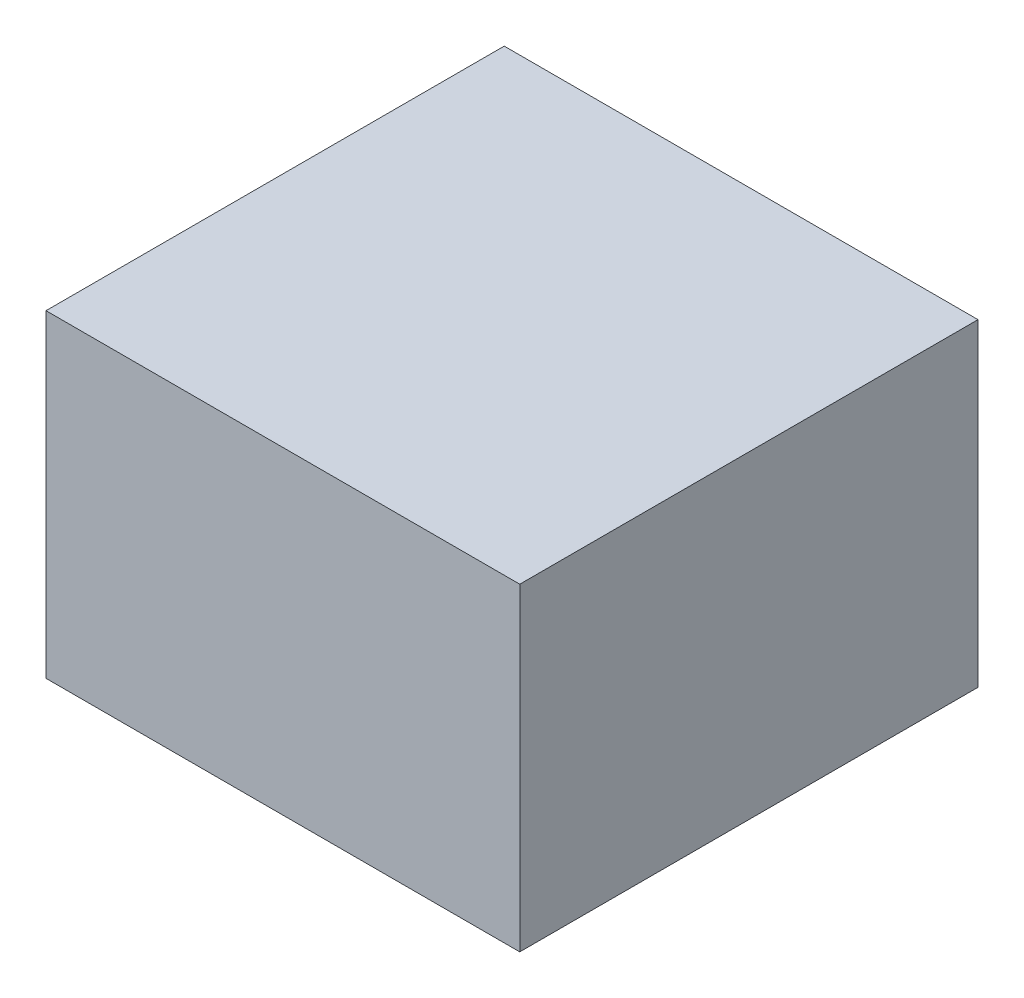
ISO-10303-21;
HEADER;
FILE_DESCRIPTION(('STEP AP214'),'2;1');
FILE_NAME('part.step','',(''),(''),'','','');
FILE_SCHEMA(('AUTOMOTIVE_DESIGN { 1 0 10303 214 1 1 1 1 }'));
ENDSEC;
DATA;
#1=APPLICATION_CONTEXT('core data for automotive mechanical design processes');
#2=APPLICATION_PROTOCOL_DEFINITION('international standard','automotive_design',2000,#1);
#3=PRODUCT_CONTEXT('',#1,'mechanical');
#4=PRODUCT('Part','Part','',(#3));
#5=PRODUCT_RELATED_PRODUCT_CATEGORY('part','',(#4));
#6=PRODUCT_DEFINITION_FORMATION('','',#4);
#7=PRODUCT_DEFINITION_CONTEXT('part definition',#1,'design');
#8=PRODUCT_DEFINITION('design','',#6,#7);
#9=PRODUCT_DEFINITION_SHAPE('','',#8);
#10=(LENGTH_UNIT() NAMED_UNIT(*) SI_UNIT(.MILLI.,.METRE.));
#11=(NAMED_UNIT(*) PLANE_ANGLE_UNIT() SI_UNIT($,.RADIAN.));
#12=(NAMED_UNIT(*) SI_UNIT($,.STERADIAN.) SOLID_ANGLE_UNIT());
#13=UNCERTAINTY_MEASURE_WITH_UNIT(LENGTH_MEASURE(1.E-05),#10,'distance_accuracy_value','');
#14=(GEOMETRIC_REPRESENTATION_CONTEXT(3) GLOBAL_UNCERTAINTY_ASSIGNED_CONTEXT((#13)) GLOBAL_UNIT_ASSIGNED_CONTEXT((#10,
#11,#12)) REPRESENTATION_CONTEXT('',''));
#15=CARTESIAN_POINT('',(0.,0.,0.));
#16=DIRECTION('',(0.,0.,1.));
#17=DIRECTION('',(1.,0.,0.));
#18=AXIS2_PLACEMENT_3D('',#15,#16,#17);
#19=CARTESIAN_POINT('',(7.747,-5.207,14.986));
#20=DIRECTION('',(-1.,0.,0.));
#21=DIRECTION('',(0.,0.,1.));
#22=AXIS2_PLACEMENT_3D('',#19,#20,#21);
#23=PLANE('',#22);
#24=DIRECTION('',(0.,1.,0.));
#25=VECTOR('',#24,1.);
#26=CARTESIAN_POINT('',(7.747,-5.207,0.));
#27=LINE('',#26,#25);
#28=CARTESIAN_POINT('',(7.747,-5.207,0.));
#29=VERTEX_POINT('',#28);
#30=CARTESIAN_POINT('',(7.747,5.207,0.));
#31=VERTEX_POINT('',#30);
#32=EDGE_CURVE('E107',#29,#31,#27,.T.);
#33=ORIENTED_EDGE('',*,*,#32,.T.);
#34=DIRECTION('',(0.,0.,-1.));
#35=VECTOR('',#34,1.);
#36=CARTESIAN_POINT('',(7.747,5.207,14.986));
#37=LINE('',#36,#35);
#38=CARTESIAN_POINT('',(7.747,5.207,14.986));
#39=VERTEX_POINT('',#38);
#40=EDGE_CURVE('E11',#39,#31,#37,.T.);
#41=ORIENTED_EDGE('',*,*,#40,.F.);
#42=DIRECTION('',(0.,1.,0.));
#43=VECTOR('',#42,1.);
#44=CARTESIAN_POINT('',(7.747,-5.207,14.986));
#45=LINE('',#44,#43);
#46=CARTESIAN_POINT('',(7.747,-5.207,14.986));
#47=VERTEX_POINT('',#46);
#48=EDGE_CURVE('E91',#47,#39,#45,.T.);
#49=ORIENTED_EDGE('',*,*,#48,.F.);
#50=DIRECTION('',(0.,0.,-1.));
#51=VECTOR('',#50,1.);
#52=CARTESIAN_POINT('',(7.747,-5.207,14.986));
#53=LINE('',#52,#51);
#54=EDGE_CURVE('E103',#47,#29,#53,.T.);
#55=ORIENTED_EDGE('',*,*,#54,.T.);
#56=EDGE_LOOP('',(#33,#41,#49,#55));
#57=FACE_BOUND('',#56,.T.);
#58=ADVANCED_FACE('F39',(#57),#23,.F.);
#59=CARTESIAN_POINT('',(-7.747,5.207,14.986));
#60=DIRECTION('',(0.,-1.,0.));
#61=DIRECTION('',(0.,0.,-1.));
#62=AXIS2_PLACEMENT_3D('',#59,#60,#61);
#63=PLANE('',#62);
#64=DIRECTION('',(-1.,0.,0.));
#65=VECTOR('',#64,1.);
#66=CARTESIAN_POINT('',(-7.747,5.207,0.));
#67=LINE('',#66,#65);
#68=CARTESIAN_POINT('',(-7.747,5.207,0.));
#69=VERTEX_POINT('',#68);
#70=EDGE_CURVE('E96',#31,#69,#67,.T.);
#71=ORIENTED_EDGE('',*,*,#70,.T.);
#72=DIRECTION('',(0.,0.,-1.));
#73=VECTOR('',#72,1.);
#74=CARTESIAN_POINT('',(-7.747,5.207,14.986));
#75=LINE('',#74,#73);
#76=CARTESIAN_POINT('',(-7.747,5.207,14.986));
#77=VERTEX_POINT('',#76);
#78=EDGE_CURVE('E48',#77,#69,#75,.T.);
#79=ORIENTED_EDGE('',*,*,#78,.F.);
#80=DIRECTION('',(-1.,0.,0.));
#81=VECTOR('',#80,1.);
#82=CARTESIAN_POINT('',(-7.747,5.207,14.986));
#83=LINE('',#82,#81);
#84=EDGE_CURVE('E86',#39,#77,#83,.T.);
#85=ORIENTED_EDGE('',*,*,#84,.F.);
#86=ORIENTED_EDGE('',*,*,#40,.T.);
#87=EDGE_LOOP('',(#71,#79,#85,#86));
#88=FACE_BOUND('',#87,.T.);
#89=ADVANCED_FACE('F95',(#88),#63,.F.);
#90=CARTESIAN_POINT('',(-7.747,-5.207,14.986));
#91=DIRECTION('',(1.,0.,0.));
#92=DIRECTION('',(0.,0.,-1.));
#93=AXIS2_PLACEMENT_3D('',#90,#91,#92);
#94=PLANE('',#93);
#95=DIRECTION('',(0.,-1.,0.));
#96=VECTOR('',#95,1.);
#97=CARTESIAN_POINT('',(-7.747,-5.207,0.));
#98=LINE('',#97,#96);
#99=CARTESIAN_POINT('',(-7.747,-5.207,0.));
#100=VERTEX_POINT('',#99);
#101=EDGE_CURVE('E73',#69,#100,#98,.T.);
#102=ORIENTED_EDGE('',*,*,#101,.T.);
#103=DIRECTION('',(0.,0.,-1.));
#104=VECTOR('',#103,1.);
#105=CARTESIAN_POINT('',(-7.747,-5.207,14.986));
#106=LINE('',#105,#104);
#107=CARTESIAN_POINT('',(-7.747,-5.207,14.986));
#108=VERTEX_POINT('',#107);
#109=EDGE_CURVE('E98',#108,#100,#106,.T.);
#110=ORIENTED_EDGE('',*,*,#109,.F.);
#111=DIRECTION('',(0.,-1.,0.));
#112=VECTOR('',#111,1.);
#113=CARTESIAN_POINT('',(-7.747,-5.207,14.986));
#114=LINE('',#113,#112);
#115=EDGE_CURVE('E89',#77,#108,#114,.T.);
#116=ORIENTED_EDGE('',*,*,#115,.F.);
#117=ORIENTED_EDGE('',*,*,#78,.T.);
#118=EDGE_LOOP('',(#102,#110,#116,#117));
#119=FACE_BOUND('',#118,.T.);
#120=ADVANCED_FACE('F99',(#119),#94,.F.);
#121=CARTESIAN_POINT('',(-7.747,-5.207,14.986));
#122=DIRECTION('',(0.,1.,0.));
#123=DIRECTION('',(0.,0.,1.));
#124=AXIS2_PLACEMENT_3D('',#121,#122,#123);
#125=PLANE('',#124);
#126=DIRECTION('',(1.,0.,0.));
#127=VECTOR('',#126,1.);
#128=CARTESIAN_POINT('',(-7.747,-5.207,0.));
#129=LINE('',#128,#127);
#130=EDGE_CURVE('E79',#100,#29,#129,.T.);
#131=ORIENTED_EDGE('',*,*,#130,.T.);
#132=ORIENTED_EDGE('',*,*,#54,.F.);
#133=DIRECTION('',(1.,0.,0.));
#134=VECTOR('',#133,1.);
#135=CARTESIAN_POINT('',(-7.747,-5.207,14.986));
#136=LINE('',#135,#134);
#137=EDGE_CURVE('E56',#108,#47,#136,.T.);
#138=ORIENTED_EDGE('',*,*,#137,.F.);
#139=ORIENTED_EDGE('',*,*,#109,.T.);
#140=EDGE_LOOP('',(#131,#132,#138,#139));
#141=FACE_BOUND('',#140,.T.);
#142=ADVANCED_FACE('F120',(#141),#125,.F.);
#143=CARTESIAN_POINT('',(0.,0.,14.986));
#144=DIRECTION('',(0.,0.,-1.));
#145=DIRECTION('',(-1.,0.,0.));
#146=AXIS2_PLACEMENT_3D('',#143,#144,#145);
#147=PLANE('',#146);
#148=ORIENTED_EDGE('',*,*,#48,.T.);
#149=ORIENTED_EDGE('',*,*,#84,.T.);
#150=ORIENTED_EDGE('',*,*,#115,.T.);
#151=ORIENTED_EDGE('',*,*,#137,.T.);
#152=EDGE_LOOP('',(#148,#149,#150,#151));
#153=FACE_BOUND('',#152,.T.);
#154=ADVANCED_FACE('F87',(#153),#147,.F.);
#155=CARTESIAN_POINT('',(0.,0.,0.));
#156=DIRECTION('',(0.,0.,-1.));
#157=DIRECTION('',(-1.,0.,0.));
#158=AXIS2_PLACEMENT_3D('',#155,#156,#157);
#159=PLANE('',#158);
#160=ORIENTED_EDGE('',*,*,#32,.F.);
#161=ORIENTED_EDGE('',*,*,#130,.F.);
#162=ORIENTED_EDGE('',*,*,#101,.F.);
#163=ORIENTED_EDGE('',*,*,#70,.F.);
#164=EDGE_LOOP('',(#160,#161,#162,#163));
#165=FACE_BOUND('',#164,.T.);
#166=ADVANCED_FACE('F123',(#165),#159,.T.);
#167=CLOSED_SHELL('',(#58,#89,#120,#142,#154,#166));
#168=MANIFOLD_SOLID_BREP('B2',#167);
#169=ADVANCED_BREP_SHAPE_REPRESENTATION('',(#18,#168),#14);
#170=SHAPE_DEFINITION_REPRESENTATION(#9,#169);
ENDSEC;
END-ISO-10303-21;
